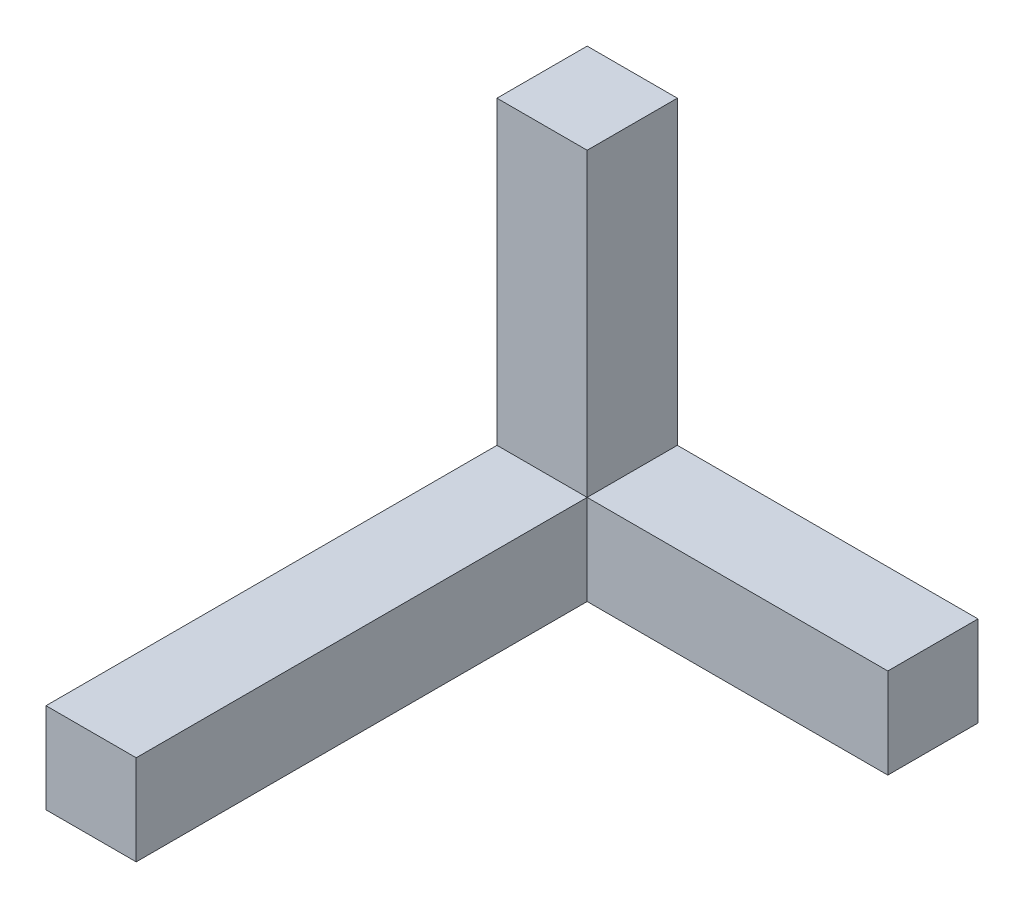
ISO-10303-21;
HEADER;
FILE_DESCRIPTION(('STEP AP214'),'2;1');
FILE_NAME('part.step','',(''),(''),'','','');
FILE_SCHEMA(('AUTOMOTIVE_DESIGN { 1 0 10303 214 1 1 1 1 }'));
ENDSEC;
DATA;
#1=APPLICATION_CONTEXT('core data for automotive mechanical design processes');
#2=APPLICATION_PROTOCOL_DEFINITION('international standard','automotive_design',2000,#1);
#3=PRODUCT_CONTEXT('',#1,'mechanical');
#4=PRODUCT('Part','Part','',(#3));
#5=PRODUCT_RELATED_PRODUCT_CATEGORY('part','',(#4));
#6=PRODUCT_DEFINITION_FORMATION('','',#4);
#7=PRODUCT_DEFINITION_CONTEXT('part definition',#1,'design');
#8=PRODUCT_DEFINITION('design','',#6,#7);
#9=PRODUCT_DEFINITION_SHAPE('','',#8);
#10=(LENGTH_UNIT() NAMED_UNIT(*) SI_UNIT(.MILLI.,.METRE.));
#11=(NAMED_UNIT(*) PLANE_ANGLE_UNIT() SI_UNIT($,.RADIAN.));
#12=(NAMED_UNIT(*) SI_UNIT($,.STERADIAN.) SOLID_ANGLE_UNIT());
#13=UNCERTAINTY_MEASURE_WITH_UNIT(LENGTH_MEASURE(1.E-05),#10,'distance_accuracy_value','');
#14=(GEOMETRIC_REPRESENTATION_CONTEXT(3) GLOBAL_UNCERTAINTY_ASSIGNED_CONTEXT((#13)) GLOBAL_UNIT_ASSIGNED_CONTEXT((#10,
#11,#12)) REPRESENTATION_CONTEXT('',''));
#15=CARTESIAN_POINT('',(0.,0.,0.));
#16=DIRECTION('',(0.,0.,1.));
#17=DIRECTION('',(1.,0.,0.));
#18=AXIS2_PLACEMENT_3D('',#15,#16,#17);
#19=CARTESIAN_POINT('',(-1.5,-1.5,15.));
#20=DIRECTION('',(1.,0.,0.));
#21=DIRECTION('',(0.,0.,-1.));
#22=AXIS2_PLACEMENT_3D('',#19,#20,#21);
#23=PLANE('',#22);
#24=DIRECTION('',(0.,-1.,0.));
#25=VECTOR('',#24,1.);
#26=CARTESIAN_POINT('',(-1.5,11.5,12.));
#27=LINE('',#26,#25);
#28=CARTESIAN_POINT('',(-1.5,11.5,12.));
#29=VERTEX_POINT('',#28);
#30=CARTESIAN_POINT('',(-1.5,-1.5,12.));
#31=VERTEX_POINT('',#30);
#32=EDGE_CURVE('E124',#29,#31,#27,.T.);
#33=ORIENTED_EDGE('',*,*,#32,.T.);
#34=DIRECTION('',(0.,0.,-1.));
#35=VECTOR('',#34,1.);
#36=CARTESIAN_POINT('',(-1.5,-1.5,15.));
#37=LINE('',#36,#35);
#38=CARTESIAN_POINT('',(-1.5,-1.5,30.));
#39=VERTEX_POINT('',#38);
#40=EDGE_CURVE('E11',#39,#31,#37,.T.);
#41=ORIENTED_EDGE('',*,*,#40,.F.);
#42=DIRECTION('',(0.,-1.,0.));
#43=VECTOR('',#42,1.);
#44=CARTESIAN_POINT('',(-1.5,1.5,30.));
#45=LINE('',#44,#43);
#46=CARTESIAN_POINT('',(-1.5,1.5,30.));
#47=VERTEX_POINT('',#46);
#48=EDGE_CURVE('E176',#47,#39,#45,.T.);
#49=ORIENTED_EDGE('',*,*,#48,.F.);
#50=DIRECTION('',(0.,0.,-1.));
#51=VECTOR('',#50,1.);
#52=CARTESIAN_POINT('',(-1.5,1.5,30.));
#53=LINE('',#52,#51);
#54=CARTESIAN_POINT('',(-1.5,1.5,15.));
#55=VERTEX_POINT('',#54);
#56=EDGE_CURVE('E134',#47,#55,#53,.T.);
#57=ORIENTED_EDGE('',*,*,#56,.T.);
#58=DIRECTION('',(0.,-1.,0.));
#59=VECTOR('',#58,1.);
#60=CARTESIAN_POINT('',(-1.5,-1.5,15.));
#61=LINE('',#60,#59);
#62=CARTESIAN_POINT('',(-1.5,11.5,15.));
#63=VERTEX_POINT('',#62);
#64=EDGE_CURVE('E153',#63,#55,#61,.T.);
#65=ORIENTED_EDGE('',*,*,#64,.F.);
#66=DIRECTION('',(0.,0.,1.));
#67=VECTOR('',#66,1.);
#68=CARTESIAN_POINT('',(-1.5,11.5,12.));
#69=LINE('',#68,#67);
#70=EDGE_CURVE('E169',#29,#63,#69,.T.);
#71=ORIENTED_EDGE('',*,*,#70,.F.);
#72=EDGE_LOOP('',(#33,#41,#49,#57,#65,#71));
#73=FACE_BOUND('',#72,.T.);
#74=ADVANCED_FACE('F35',(#73),#23,.F.);
#75=CARTESIAN_POINT('',(-1.5,-1.5,15.));
#76=DIRECTION('',(0.,1.,0.));
#77=DIRECTION('',(0.,0.,1.));
#78=AXIS2_PLACEMENT_3D('',#75,#76,#77);
#79=PLANE('',#78);
#80=ORIENTED_EDGE('',*,*,#40,.T.);
#81=DIRECTION('',(-1.,0.,0.));
#82=VECTOR('',#81,1.);
#83=CARTESIAN_POINT('',(11.5,-1.5,12.));
#84=LINE('',#83,#82);
#85=CARTESIAN_POINT('',(11.5,-1.5,12.));
#86=VERTEX_POINT('',#85);
#87=EDGE_CURVE('E113',#86,#31,#84,.T.);
#88=ORIENTED_EDGE('',*,*,#87,.F.);
#89=DIRECTION('',(0.,0.,-1.));
#90=VECTOR('',#89,1.);
#91=CARTESIAN_POINT('',(11.5,-1.5,15.));
#92=LINE('',#91,#90);
#93=CARTESIAN_POINT('',(11.5,-1.5,15.));
#94=VERTEX_POINT('',#93);
#95=EDGE_CURVE('E145',#94,#86,#92,.T.);
#96=ORIENTED_EDGE('',*,*,#95,.F.);
#97=DIRECTION('',(1.,0.,0.));
#98=VECTOR('',#97,1.);
#99=CARTESIAN_POINT('',(-1.5,-1.5,15.));
#100=LINE('',#99,#98);
#101=CARTESIAN_POINT('',(1.5,-1.5,15.));
#102=VERTEX_POINT('',#101);
#103=EDGE_CURVE('E43',#102,#94,#100,.T.);
#104=ORIENTED_EDGE('',*,*,#103,.F.);
#105=DIRECTION('',(0.,0.,-1.));
#106=VECTOR('',#105,1.);
#107=CARTESIAN_POINT('',(1.5,-1.5,30.));
#108=LINE('',#107,#106);
#109=CARTESIAN_POINT('',(1.5,-1.5,30.));
#110=VERTEX_POINT('',#109);
#111=EDGE_CURVE('E172',#110,#102,#108,.T.);
#112=ORIENTED_EDGE('',*,*,#111,.F.);
#113=DIRECTION('',(1.,0.,0.));
#114=VECTOR('',#113,1.);
#115=CARTESIAN_POINT('',(1.5,-1.5,30.));
#116=LINE('',#115,#114);
#117=EDGE_CURVE('E171',#39,#110,#116,.T.);
#118=ORIENTED_EDGE('',*,*,#117,.F.);
#119=EDGE_LOOP('',(#80,#88,#96,#104,#112,#118));
#120=FACE_BOUND('',#119,.T.);
#121=ADVANCED_FACE('F161',(#120),#79,.F.);
#122=CARTESIAN_POINT('',(0.,0.,15.));
#123=DIRECTION('',(0.,0.,-1.));
#124=DIRECTION('',(-1.,0.,0.));
#125=AXIS2_PLACEMENT_3D('',#122,#123,#124);
#126=PLANE('',#125);
#127=DIRECTION('',(0.,1.,0.));
#128=VECTOR('',#127,1.);
#129=CARTESIAN_POINT('',(1.5,1.5,15.));
#130=LINE('',#129,#128);
#131=CARTESIAN_POINT('',(1.5,1.5,15.));
#132=VERTEX_POINT('',#131);
#133=EDGE_CURVE('E50',#102,#132,#130,.T.);
#134=ORIENTED_EDGE('',*,*,#133,.F.);
#135=ORIENTED_EDGE('',*,*,#103,.T.);
#136=DIRECTION('',(0.,-1.,0.));
#137=VECTOR('',#136,1.);
#138=CARTESIAN_POINT('',(11.5,1.5,15.));
#139=LINE('',#138,#137);
#140=CARTESIAN_POINT('',(11.5,1.5,15.));
#141=VERTEX_POINT('',#140);
#142=EDGE_CURVE('E123',#141,#94,#139,.T.);
#143=ORIENTED_EDGE('',*,*,#142,.F.);
#144=DIRECTION('',(-1.,0.,0.));
#145=VECTOR('',#144,1.);
#146=CARTESIAN_POINT('',(-1.5,1.5,15.));
#147=LINE('',#146,#145);
#148=EDGE_CURVE('E151',#141,#132,#147,.T.);
#149=ORIENTED_EDGE('',*,*,#148,.T.);
#150=EDGE_LOOP('',(#134,#135,#143,#149));
#151=FACE_BOUND('',#150,.T.);
#152=ADVANCED_FACE('F156',(#151),#126,.F.);
#153=DIRECTION('',(-1.,0.,0.));
#154=VECTOR('',#153,1.);
#155=CARTESIAN_POINT('',(1.5,1.5,15.));
#156=LINE('',#155,#154);
#157=EDGE_CURVE('E58',#132,#55,#156,.T.);
#158=ORIENTED_EDGE('',*,*,#157,.F.);
#159=DIRECTION('',(0.,-1.,0.));
#160=VECTOR('',#159,1.);
#161=CARTESIAN_POINT('',(1.5,11.5,15.));
#162=LINE('',#161,#160);
#163=CARTESIAN_POINT('',(1.5,11.5,15.));
#164=VERTEX_POINT('',#163);
#165=EDGE_CURVE('E128',#164,#132,#162,.T.);
#166=ORIENTED_EDGE('',*,*,#165,.F.);
#167=DIRECTION('',(1.,0.,0.));
#168=VECTOR('',#167,1.);
#169=CARTESIAN_POINT('',(1.5,11.5,15.));
#170=LINE('',#169,#168);
#171=EDGE_CURVE('E138',#63,#164,#170,.T.);
#172=ORIENTED_EDGE('',*,*,#171,.F.);
#173=ORIENTED_EDGE('',*,*,#64,.T.);
#174=EDGE_LOOP('',(#158,#166,#172,#173));
#175=FACE_BOUND('',#174,.T.);
#176=ADVANCED_FACE('F191',(#175),#126,.F.);
#177=CARTESIAN_POINT('',(-1.5,1.5,15.));
#178=DIRECTION('',(0.,-1.,0.));
#179=DIRECTION('',(0.,0.,-1.));
#180=AXIS2_PLACEMENT_3D('',#177,#178,#179);
#181=PLANE('',#180);
#182=DIRECTION('',(0.,0.,-1.));
#183=VECTOR('',#182,1.);
#184=CARTESIAN_POINT('',(1.5,1.5,12.));
#185=LINE('',#184,#183);
#186=CARTESIAN_POINT('',(1.5,1.5,12.));
#187=VERTEX_POINT('',#186);
#188=EDGE_CURVE('E108',#132,#187,#185,.T.);
#189=ORIENTED_EDGE('',*,*,#188,.F.);
#190=ORIENTED_EDGE('',*,*,#148,.F.);
#191=DIRECTION('',(0.,0.,1.));
#192=VECTOR('',#191,1.);
#193=CARTESIAN_POINT('',(11.5,1.5,15.));
#194=LINE('',#193,#192);
#195=CARTESIAN_POINT('',(11.5,1.5,12.));
#196=VERTEX_POINT('',#195);
#197=EDGE_CURVE('E110',#196,#141,#194,.T.);
#198=ORIENTED_EDGE('',*,*,#197,.F.);
#199=DIRECTION('',(-1.,0.,0.));
#200=VECTOR('',#199,1.);
#201=CARTESIAN_POINT('',(11.5,1.5,12.));
#202=LINE('',#201,#200);
#203=EDGE_CURVE('E105',#196,#187,#202,.T.);
#204=ORIENTED_EDGE('',*,*,#203,.T.);
#205=EDGE_LOOP('',(#189,#190,#198,#204));
#206=FACE_BOUND('',#205,.T.);
#207=ADVANCED_FACE('F37',(#206),#181,.F.);
#208=CARTESIAN_POINT('',(11.5,1.5,12.));
#209=DIRECTION('',(0.,0.,1.));
#210=DIRECTION('',(1.,0.,0.));
#211=AXIS2_PLACEMENT_3D('',#208,#209,#210);
#212=PLANE('',#211);
#213=ORIENTED_EDGE('',*,*,#87,.T.);
#214=ORIENTED_EDGE('',*,*,#32,.F.);
#215=DIRECTION('',(-1.,0.,0.));
#216=VECTOR('',#215,1.);
#217=CARTESIAN_POINT('',(1.5,11.5,12.));
#218=LINE('',#217,#216);
#219=CARTESIAN_POINT('',(1.5,11.5,12.));
#220=VERTEX_POINT('',#219);
#221=EDGE_CURVE('E119',#220,#29,#218,.T.);
#222=ORIENTED_EDGE('',*,*,#221,.F.);
#223=DIRECTION('',(0.,-1.,0.));
#224=VECTOR('',#223,1.);
#225=CARTESIAN_POINT('',(1.5,11.5,12.));
#226=LINE('',#225,#224);
#227=EDGE_CURVE('E116',#220,#187,#226,.T.);
#228=ORIENTED_EDGE('',*,*,#227,.T.);
#229=ORIENTED_EDGE('',*,*,#203,.F.);
#230=DIRECTION('',(0.,1.,0.));
#231=VECTOR('',#230,1.);
#232=CARTESIAN_POINT('',(11.5,1.5,12.));
#233=LINE('',#232,#231);
#234=EDGE_CURVE('E147',#86,#196,#233,.T.);
#235=ORIENTED_EDGE('',*,*,#234,.F.);
#236=EDGE_LOOP('',(#213,#214,#222,#228,#229,#235));
#237=FACE_BOUND('',#236,.T.);
#238=ADVANCED_FACE('F117',(#237),#212,.F.);
#239=CARTESIAN_POINT('',(11.5,0.,0.));
#240=DIRECTION('',(1.,0.,0.));
#241=DIRECTION('',(0.,0.,-1.));
#242=AXIS2_PLACEMENT_3D('',#239,#240,#241);
#243=PLANE('',#242);
#244=ORIENTED_EDGE('',*,*,#142,.T.);
#245=ORIENTED_EDGE('',*,*,#95,.T.);
#246=ORIENTED_EDGE('',*,*,#234,.T.);
#247=ORIENTED_EDGE('',*,*,#197,.T.);
#248=EDGE_LOOP('',(#244,#245,#246,#247));
#249=FACE_BOUND('',#248,.T.);
#250=ADVANCED_FACE('F163',(#249),#243,.T.);
#251=CARTESIAN_POINT('',(1.5,11.5,12.));
#252=DIRECTION('',(-1.,0.,0.));
#253=DIRECTION('',(0.,0.,1.));
#254=AXIS2_PLACEMENT_3D('',#251,#252,#253);
#255=PLANE('',#254);
#256=ORIENTED_EDGE('',*,*,#188,.T.);
#257=ORIENTED_EDGE('',*,*,#227,.F.);
#258=DIRECTION('',(0.,0.,-1.));
#259=VECTOR('',#258,1.);
#260=CARTESIAN_POINT('',(1.5,11.5,12.));
#261=LINE('',#260,#259);
#262=EDGE_CURVE('E130',#164,#220,#261,.T.);
#263=ORIENTED_EDGE('',*,*,#262,.F.);
#264=ORIENTED_EDGE('',*,*,#165,.T.);
#265=EDGE_LOOP('',(#256,#257,#263,#264));
#266=FACE_BOUND('',#265,.T.);
#267=ADVANCED_FACE('F127',(#266),#255,.F.);
#268=CARTESIAN_POINT('',(0.,11.5,0.));
#269=DIRECTION('',(0.,-1.,0.));
#270=DIRECTION('',(0.,0.,-1.));
#271=AXIS2_PLACEMENT_3D('',#268,#269,#270);
#272=PLANE('',#271);
#273=ORIENTED_EDGE('',*,*,#262,.T.);
#274=ORIENTED_EDGE('',*,*,#221,.T.);
#275=ORIENTED_EDGE('',*,*,#70,.T.);
#276=ORIENTED_EDGE('',*,*,#171,.T.);
#277=EDGE_LOOP('',(#273,#274,#275,#276));
#278=FACE_BOUND('',#277,.T.);
#279=ADVANCED_FACE('F190',(#278),#272,.F.);
#280=CARTESIAN_POINT('',(1.5,1.5,30.));
#281=DIRECTION('',(-1.,0.,0.));
#282=DIRECTION('',(0.,0.,1.));
#283=AXIS2_PLACEMENT_3D('',#280,#281,#282);
#284=PLANE('',#283);
#285=ORIENTED_EDGE('',*,*,#133,.T.);
#286=DIRECTION('',(0.,0.,-1.));
#287=VECTOR('',#286,1.);
#288=CARTESIAN_POINT('',(1.5,1.5,30.));
#289=LINE('',#288,#287);
#290=CARTESIAN_POINT('',(1.5,1.5,30.));
#291=VERTEX_POINT('',#290);
#292=EDGE_CURVE('E131',#291,#132,#289,.T.);
#293=ORIENTED_EDGE('',*,*,#292,.F.);
#294=DIRECTION('',(0.,1.,0.));
#295=VECTOR('',#294,1.);
#296=CARTESIAN_POINT('',(1.5,1.5,30.));
#297=LINE('',#296,#295);
#298=EDGE_CURVE('E184',#110,#291,#297,.T.);
#299=ORIENTED_EDGE('',*,*,#298,.F.);
#300=ORIENTED_EDGE('',*,*,#111,.T.);
#301=EDGE_LOOP('',(#285,#293,#299,#300));
#302=FACE_BOUND('',#301,.T.);
#303=ADVANCED_FACE('F244',(#302),#284,.F.);
#304=CARTESIAN_POINT('',(1.5,1.5,30.));
#305=DIRECTION('',(0.,-1.,0.));
#306=DIRECTION('',(0.,0.,-1.));
#307=AXIS2_PLACEMENT_3D('',#304,#305,#306);
#308=PLANE('',#307);
#309=ORIENTED_EDGE('',*,*,#157,.T.);
#310=ORIENTED_EDGE('',*,*,#56,.F.);
#311=DIRECTION('',(-1.,0.,0.));
#312=VECTOR('',#311,1.);
#313=CARTESIAN_POINT('',(1.5,1.5,30.));
#314=LINE('',#313,#312);
#315=EDGE_CURVE('E179',#291,#47,#314,.T.);
#316=ORIENTED_EDGE('',*,*,#315,.F.);
#317=ORIENTED_EDGE('',*,*,#292,.T.);
#318=EDGE_LOOP('',(#309,#310,#316,#317));
#319=FACE_BOUND('',#318,.T.);
#320=ADVANCED_FACE('F249',(#319),#308,.F.);
#321=CARTESIAN_POINT('',(0.,0.,30.));
#322=DIRECTION('',(0.,0.,-1.));
#323=DIRECTION('',(-1.,0.,0.));
#324=AXIS2_PLACEMENT_3D('',#321,#322,#323);
#325=PLANE('',#324);
#326=ORIENTED_EDGE('',*,*,#298,.T.);
#327=ORIENTED_EDGE('',*,*,#315,.T.);
#328=ORIENTED_EDGE('',*,*,#48,.T.);
#329=ORIENTED_EDGE('',*,*,#117,.T.);
#330=EDGE_LOOP('',(#326,#327,#328,#329));
#331=FACE_BOUND('',#330,.T.);
#332=ADVANCED_FACE('F258',(#331),#325,.F.);
#333=CLOSED_SHELL('',(#74,#121,#152,#176,#207,#238,#250,#267,#279,#303,#320,#332));
#334=MANIFOLD_SOLID_BREP('B2',#333);
#335=ADVANCED_BREP_SHAPE_REPRESENTATION('',(#18,#334),#14);
#336=SHAPE_DEFINITION_REPRESENTATION(#9,#335);
ENDSEC;
END-ISO-10303-21;
